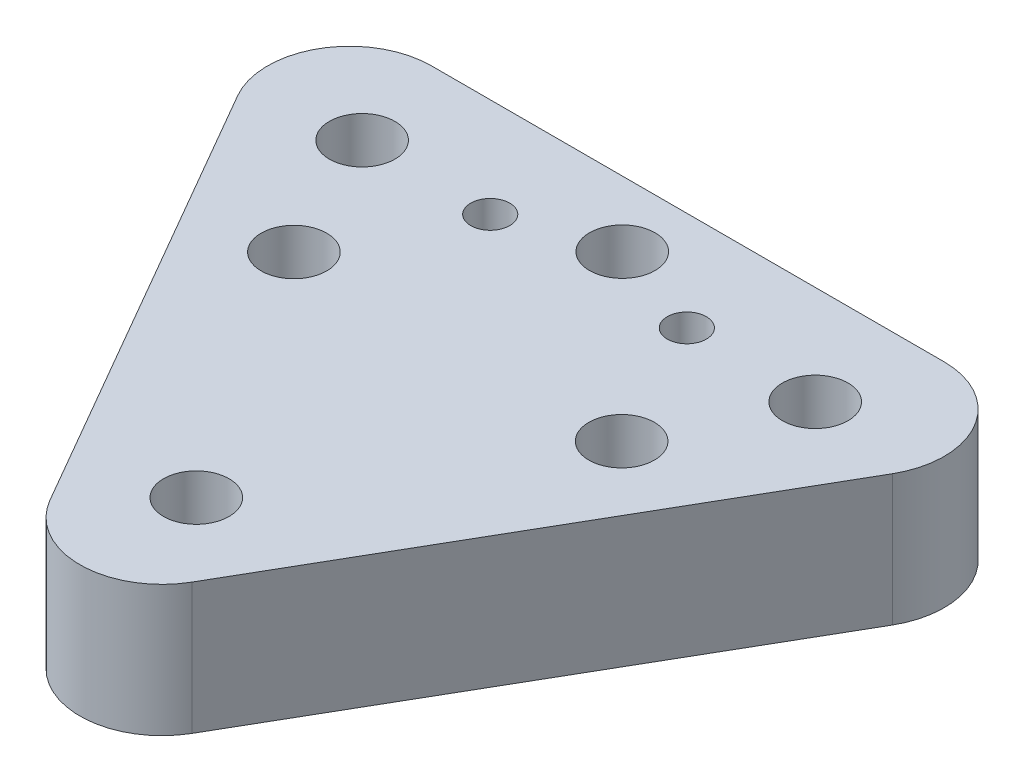
ISO-10303-21;
HEADER;
FILE_DESCRIPTION(('STEP AP214'),'2;1');
FILE_NAME('part.step','',(''),(''),'','','');
FILE_SCHEMA(('AUTOMOTIVE_DESIGN { 1 0 10303 214 1 1 1 1 }'));
ENDSEC;
DATA;
#1=APPLICATION_CONTEXT('core data for automotive mechanical design processes');
#2=APPLICATION_PROTOCOL_DEFINITION('international standard','automotive_design',2000,#1);
#3=PRODUCT_CONTEXT('',#1,'mechanical');
#4=PRODUCT('Part','Part','',(#3));
#5=PRODUCT_RELATED_PRODUCT_CATEGORY('part','',(#4));
#6=PRODUCT_DEFINITION_FORMATION('','',#4);
#7=PRODUCT_DEFINITION_CONTEXT('part definition',#1,'design');
#8=PRODUCT_DEFINITION('design','',#6,#7);
#9=PRODUCT_DEFINITION_SHAPE('','',#8);
#10=(LENGTH_UNIT() NAMED_UNIT(*) SI_UNIT(.MILLI.,.METRE.));
#11=(NAMED_UNIT(*) PLANE_ANGLE_UNIT() SI_UNIT($,.RADIAN.));
#12=(NAMED_UNIT(*) SI_UNIT($,.STERADIAN.) SOLID_ANGLE_UNIT());
#13=UNCERTAINTY_MEASURE_WITH_UNIT(LENGTH_MEASURE(1.E-05),#10,'distance_accuracy_value','');
#14=(GEOMETRIC_REPRESENTATION_CONTEXT(3) GLOBAL_UNCERTAINTY_ASSIGNED_CONTEXT((#13)) GLOBAL_UNIT_ASSIGNED_CONTEXT((#10,
#11,#12)) REPRESENTATION_CONTEXT('',''));
#15=CARTESIAN_POINT('',(0.,0.,0.));
#16=DIRECTION('',(0.,0.,1.));
#17=DIRECTION('',(1.,0.,0.));
#18=AXIS2_PLACEMENT_3D('',#15,#16,#17);
#19=CARTESIAN_POINT('',(-16.4111309816013,0.,1.40670066691386));
#20=DIRECTION('',(0.,1.,0.));
#21=DIRECTION('',(0.,0.,1.));
#22=AXIS2_PLACEMENT_3D('',#19,#20,#21);
#23=PLANE('',#22);
#24=CARTESIAN_POINT('',(1.80279534308345,0.,-4.03619239929081));
#25=DIRECTION('',(0.,1.,0.));
#26=DIRECTION('',(0.,0.,1.));
#27=AXIS2_PLACEMENT_3D('',#24,#25,#26);
#28=CIRCLE('',#27,0.595629999999993);
#29=CARTESIAN_POINT('',(1.80279534308345,0.,-3.44056239929081));
#30=VERTEX_POINT('',#29);
#31=EDGE_CURVE('E296',#30,#30,#28,.T.);
#32=ORIENTED_EDGE('',*,*,#31,.T.);
#33=EDGE_LOOP('',(#32));
#34=FACE_BOUND('',#33,.T.);
#35=CARTESIAN_POINT('',(7.80279534308345,0.,-4.03619239929081));
#36=DIRECTION('',(0.,1.,0.));
#37=DIRECTION('',(0.,0.,1.));
#38=AXIS2_PLACEMENT_3D('',#35,#36,#37);
#39=CIRCLE('',#38,0.595629999999994);
#40=CARTESIAN_POINT('',(7.80279534308345,0.,-3.44056239929081));
#41=VERTEX_POINT('',#40);
#42=EDGE_CURVE('E305',#41,#41,#39,.T.);
#43=ORIENTED_EDGE('',*,*,#42,.T.);
#44=EDGE_LOOP('',(#43));
#45=FACE_BOUND('',#44,.T.);
#46=CARTESIAN_POINT('',(4.80279534308345,0.,-5.06619239929081));
#47=DIRECTION('',(0.,-1.,0.));
#48=DIRECTION('',(0.,0.,-1.));
#49=AXIS2_PLACEMENT_3D('',#46,#47,#48);
#50=CIRCLE('',#49,0.999999999999989);
#51=CARTESIAN_POINT('',(4.80279534308345,0.,-6.06619239929079));
#52=VERTEX_POINT('',#51);
#53=EDGE_CURVE('E168',#52,#52,#50,.T.);
#54=ORIENTED_EDGE('',*,*,#53,.F.);
#55=EDGE_LOOP('',(#54));
#56=FACE_BOUND('',#55,.T.);
#57=CARTESIAN_POINT('',(9.80279534308345,0.,-0.0461923992908066));
#58=DIRECTION('',(0.,-1.,0.));
#59=DIRECTION('',(0.,0.,-1.));
#60=AXIS2_PLACEMENT_3D('',#57,#58,#59);
#61=CIRCLE('',#60,0.999999999999989);
#62=CARTESIAN_POINT('',(9.80279534308345,0.,-1.0461923992908));
#63=VERTEX_POINT('',#62);
#64=EDGE_CURVE('E158',#63,#63,#61,.T.);
#65=ORIENTED_EDGE('',*,*,#64,.F.);
#66=EDGE_LOOP('',(#65));
#67=FACE_BOUND('',#66,.T.);
#68=CARTESIAN_POINT('',(-0.197204656916548,0.,-0.0461923992908066));
#69=DIRECTION('',(0.,-1.,0.));
#70=DIRECTION('',(0.,0.,-1.));
#71=AXIS2_PLACEMENT_3D('',#68,#69,#70);
#72=CIRCLE('',#71,0.999999999999989);
#73=CARTESIAN_POINT('',(-0.197204656916548,0.,-1.0461923992908));
#74=VERTEX_POINT('',#73);
#75=EDGE_CURVE('E155',#74,#74,#72,.T.);
#76=ORIENTED_EDGE('',*,*,#75,.F.);
#77=EDGE_LOOP('',(#76));
#78=FACE_BOUND('',#77,.T.);
#79=CARTESIAN_POINT('',(4.80279534308345,0.,-0.0491349625871208));
#80=DIRECTION('',(0.,-1.,0.));
#81=DIRECTION('',(0.,0.,-1.));
#82=AXIS2_PLACEMENT_3D('',#79,#80,#81);
#83=CIRCLE('',#82,0.799999999999999);
#84=CARTESIAN_POINT('',(4.80279534308345,0.,-0.84913496258712));
#85=VERTEX_POINT('',#84);
#86=EDGE_CURVE('E154',#85,#85,#83,.T.);
#87=ORIENTED_EDGE('',*,*,#86,.F.);
#88=EDGE_LOOP('',(#87));
#89=FACE_BOUND('',#88,.T.);
#90=CARTESIAN_POINT('',(11.71622639985,0.,-4.04060624423512));
#91=DIRECTION('',(0.,1.,0.));
#92=DIRECTION('',(0.,0.,1.));
#93=AXIS2_PLACEMENT_3D('',#90,#91,#92);
#94=CIRCLE('',#93,2.38124999999938);
#95=CARTESIAN_POINT('',(11.71622639985,0.,-1.65935624423574));
#96=VERTEX_POINT('',#95);
#97=EDGE_CURVE('E182',#96,#96,#94,.T.);
#98=ORIENTED_EDGE('',*,*,#97,.T.);
#99=EDGE_LOOP('',(#98));
#100=FACE_BOUND('',#99,.T.);
#101=CARTESIAN_POINT('',(4.80279534308331,0.,8.98497991082108));
#102=DIRECTION('',(0.,1.,0.));
#103=DIRECTION('',(0.,0.,1.));
#104=AXIS2_PLACEMENT_3D('',#101,#102,#103);
#105=CIRCLE('',#104,2.49999999999972);
#106=CARTESIAN_POINT('',(6.96785885254439,0.,10.2349799108209));
#107=VERTEX_POINT('',#106);
#108=CARTESIAN_POINT('',(2.63773183362258,0.,10.2349799108209));
#109=VERTEX_POINT('',#108);
#110=EDGE_CURVE('E126',#107,#109,#105,.F.);
#111=ORIENTED_EDGE('',*,*,#110,.T.);
#112=DIRECTION('',(0.500000000000009,0.,0.866025403784434));
#113=VECTOR('',#112,1.);
#114=CARTESIAN_POINT('',(-5.94724091864677,0.,-4.63462907770371));
#115=LINE('',#114,#113);
#116=CARTESIAN_POINT('',(-5.18604114745575,0.,-3.3161923992911));
#117=VERTEX_POINT('',#116);
#118=EDGE_CURVE('E139',#117,#109,#115,.T.);
#119=ORIENTED_EDGE('',*,*,#118,.F.);
#120=CARTESIAN_POINT('',(-3.02097763799502,0.,-4.56619239929088));
#121=DIRECTION('',(0.,1.,0.));
#122=DIRECTION('',(0.,0.,1.));
#123=AXIS2_PLACEMENT_3D('',#120,#121,#122);
#124=CIRCLE('',#123,2.49999999999975);
#125=CARTESIAN_POINT('',(-3.02097763799485,0.,-7.06619239929081));
#126=VERTEX_POINT('',#125);
#127=EDGE_CURVE('E137',#117,#126,#124,.F.);
#128=ORIENTED_EDGE('',*,*,#127,.T.);
#129=DIRECTION('',(-1.,0.,0.));
#130=VECTOR('',#129,1.);
#131=CARTESIAN_POINT('',(-16.4111309816013,0.,-7.06619239929081));
#132=LINE('',#131,#130);
#133=CARTESIAN_POINT('',(12.6265683241618,0.,-7.06619239929081));
#134=VERTEX_POINT('',#133);
#135=EDGE_CURVE('E109',#134,#126,#132,.T.);
#136=ORIENTED_EDGE('',*,*,#135,.F.);
#137=CARTESIAN_POINT('',(12.6265683241616,0.,-4.56619239929093));
#138=DIRECTION('',(0.,1.,0.));
#139=DIRECTION('',(0.,0.,1.));
#140=AXIS2_PLACEMENT_3D('',#137,#138,#139);
#141=CIRCLE('',#140,2.49999999999987);
#142=CARTESIAN_POINT('',(14.7916318336227,0.,-3.31619239929111));
#143=VERTEX_POINT('',#142);
#144=EDGE_CURVE('E133',#143,#134,#141,.T.);
#145=ORIENTED_EDGE('',*,*,#144,.F.);
#146=DIRECTION('',(0.500000000000006,0.,-0.866025403784435));
#147=VECTOR('',#146,1.);
#148=CARTESIAN_POINT('',(4.94586844247103,0.,13.7371700334849));
#149=LINE('',#148,#147);
#150=EDGE_CURVE('E129',#107,#143,#149,.T.);
#151=ORIENTED_EDGE('',*,*,#150,.F.);
#152=EDGE_LOOP('',(#111,#119,#128,#136,#145,#151));
#153=FACE_BOUND('',#152,.T.);
#154=CARTESIAN_POINT('',(4.80279534308406,0.,7.93380760070919));
#155=DIRECTION('',(0.,1.,0.));
#156=DIRECTION('',(0.,0.,1.));
#157=AXIS2_PLACEMENT_3D('',#154,#155,#156);
#158=CIRCLE('',#157,2.38124999999972);
#159=CARTESIAN_POINT('',(4.80279534308406,0.,10.3150576007089));
#160=VERTEX_POINT('',#159);
#161=EDGE_CURVE('E185',#160,#160,#158,.T.);
#162=ORIENTED_EDGE('',*,*,#161,.T.);
#163=EDGE_LOOP('',(#162));
#164=FACE_BOUND('',#163,.T.);
#165=CARTESIAN_POINT('',(-2.11063571368305,0.,-4.04060624423513));
#166=DIRECTION('',(0.,1.,0.));
#167=DIRECTION('',(0.,0.,1.));
#168=AXIS2_PLACEMENT_3D('',#165,#166,#167);
#169=CIRCLE('',#168,2.38124999999953);
#170=CARTESIAN_POINT('',(-2.11063571368305,0.,-1.6593562442356));
#171=VERTEX_POINT('',#170);
#172=EDGE_CURVE('E151',#171,#171,#169,.T.);
#173=ORIENTED_EDGE('',*,*,#172,.T.);
#174=EDGE_LOOP('',(#173));
#175=FACE_BOUND('',#174,.T.);
#176=ADVANCED_FACE('F33',(#34,#45,#56,#67,#78,#89,#100,#153,#164,#175),#23,.F.);
#177=CARTESIAN_POINT('',(4.80279534308331,4.,8.98497991082108));
#178=DIRECTION('',(0.,-1.,0.));
#179=DIRECTION('',(0.,0.,-1.));
#180=AXIS2_PLACEMENT_3D('',#177,#178,#179);
#181=CYLINDRICAL_SURFACE('',#180,2.49999999999972);
#182=ORIENTED_EDGE('',*,*,#110,.F.);
#183=DIRECTION('',(0.,-1.,0.));
#184=VECTOR('',#183,1.);
#185=CARTESIAN_POINT('',(6.96785885254439,4.,10.2349799108209));
#186=LINE('',#185,#184);
#187=CARTESIAN_POINT('',(6.96785885254439,4.,10.2349799108209));
#188=VERTEX_POINT('',#187);
#189=EDGE_CURVE('E11',#188,#107,#186,.T.);
#190=ORIENTED_EDGE('',*,*,#189,.F.);
#191=CARTESIAN_POINT('',(4.80279534308331,4.,8.98497991082108));
#192=DIRECTION('',(0.,1.,0.));
#193=DIRECTION('',(0.,0.,1.));
#194=AXIS2_PLACEMENT_3D('',#191,#192,#193);
#195=CIRCLE('',#194,2.49999999999972);
#196=CARTESIAN_POINT('',(2.63773183362258,4.,10.2349799108209));
#197=VERTEX_POINT('',#196);
#198=EDGE_CURVE('E200',#188,#197,#195,.F.);
#199=ORIENTED_EDGE('',*,*,#198,.T.);
#200=DIRECTION('',(0.,-1.,0.));
#201=VECTOR('',#200,1.);
#202=CARTESIAN_POINT('',(2.63773183362258,4.,10.2349799108209));
#203=LINE('',#202,#201);
#204=EDGE_CURVE('E81',#197,#109,#203,.T.);
#205=ORIENTED_EDGE('',*,*,#204,.T.);
#206=EDGE_LOOP('',(#182,#190,#199,#205));
#207=FACE_BOUND('',#206,.T.);
#208=ADVANCED_FACE('F212',(#207),#181,.T.);
#209=CARTESIAN_POINT('',(4.94586844247103,4.,13.7371700334849));
#210=DIRECTION('',(-0.866025403784435,0.,-0.500000000000006));
#211=DIRECTION('',(-0.500000000000006,0.,0.866025403784435));
#212=AXIS2_PLACEMENT_3D('',#209,#210,#211);
#213=PLANE('',#212);
#214=ORIENTED_EDGE('',*,*,#150,.T.);
#215=DIRECTION('',(0.,-1.,0.));
#216=VECTOR('',#215,1.);
#217=CARTESIAN_POINT('',(14.7916318336227,4.,-3.31619239929111));
#218=LINE('',#217,#216);
#219=CARTESIAN_POINT('',(14.7916318336227,4.,-3.31619239929111));
#220=VERTEX_POINT('',#219);
#221=EDGE_CURVE('E43',#220,#143,#218,.T.);
#222=ORIENTED_EDGE('',*,*,#221,.F.);
#223=DIRECTION('',(0.500000000000006,0.,-0.866025403784435));
#224=VECTOR('',#223,1.);
#225=CARTESIAN_POINT('',(4.94586844247103,4.,13.7371700334849));
#226=LINE('',#225,#224);
#227=EDGE_CURVE('E202',#188,#220,#226,.T.);
#228=ORIENTED_EDGE('',*,*,#227,.F.);
#229=ORIENTED_EDGE('',*,*,#189,.T.);
#230=EDGE_LOOP('',(#214,#222,#228,#229));
#231=FACE_BOUND('',#230,.T.);
#232=ADVANCED_FACE('F205',(#231),#213,.F.);
#233=CARTESIAN_POINT('',(12.6265683241616,4.,-4.56619239929093));
#234=DIRECTION('',(0.,-1.,0.));
#235=DIRECTION('',(0.,0.,-1.));
#236=AXIS2_PLACEMENT_3D('',#233,#234,#235);
#237=CYLINDRICAL_SURFACE('',#236,2.49999999999987);
#238=ORIENTED_EDGE('',*,*,#144,.T.);
#239=DIRECTION('',(0.,-1.,0.));
#240=VECTOR('',#239,1.);
#241=CARTESIAN_POINT('',(12.6265683241618,4.,-7.06619239929081));
#242=LINE('',#241,#240);
#243=CARTESIAN_POINT('',(12.6265683241618,4.,-7.06619239929081));
#244=VERTEX_POINT('',#243);
#245=EDGE_CURVE('E113',#244,#134,#242,.T.);
#246=ORIENTED_EDGE('',*,*,#245,.F.);
#247=CARTESIAN_POINT('',(12.6265683241616,4.,-4.56619239929093));
#248=DIRECTION('',(0.,1.,0.));
#249=DIRECTION('',(0.,0.,1.));
#250=AXIS2_PLACEMENT_3D('',#247,#248,#249);
#251=CIRCLE('',#250,2.49999999999987);
#252=EDGE_CURVE('E101',#220,#244,#251,.T.);
#253=ORIENTED_EDGE('',*,*,#252,.F.);
#254=ORIENTED_EDGE('',*,*,#221,.T.);
#255=EDGE_LOOP('',(#238,#246,#253,#254));
#256=FACE_BOUND('',#255,.T.);
#257=ADVANCED_FACE('F208',(#256),#237,.T.);
#258=CARTESIAN_POINT('',(-16.4111309816013,4.,-7.06619239929081));
#259=DIRECTION('',(0.,0.,1.));
#260=DIRECTION('',(1.,0.,0.));
#261=AXIS2_PLACEMENT_3D('',#258,#259,#260);
#262=PLANE('',#261);
#263=ORIENTED_EDGE('',*,*,#135,.T.);
#264=DIRECTION('',(0.,-1.,0.));
#265=VECTOR('',#264,1.);
#266=CARTESIAN_POINT('',(-3.02097763799485,4.,-7.06619239929081));
#267=LINE('',#266,#265);
#268=CARTESIAN_POINT('',(-3.02097763799485,4.,-7.06619239929081));
#269=VERTEX_POINT('',#268);
#270=EDGE_CURVE('E107',#269,#126,#267,.T.);
#271=ORIENTED_EDGE('',*,*,#270,.F.);
#272=DIRECTION('',(-1.,0.,0.));
#273=VECTOR('',#272,1.);
#274=CARTESIAN_POINT('',(-16.4111309816013,4.,-7.06619239929081));
#275=LINE('',#274,#273);
#276=EDGE_CURVE('E94',#244,#269,#275,.T.);
#277=ORIENTED_EDGE('',*,*,#276,.F.);
#278=ORIENTED_EDGE('',*,*,#245,.T.);
#279=EDGE_LOOP('',(#263,#271,#277,#278));
#280=FACE_BOUND('',#279,.T.);
#281=ADVANCED_FACE('F108',(#280),#262,.F.);
#282=CARTESIAN_POINT('',(-3.02097763799502,4.,-4.56619239929088));
#283=DIRECTION('',(0.,-1.,0.));
#284=DIRECTION('',(0.,0.,-1.));
#285=AXIS2_PLACEMENT_3D('',#282,#283,#284);
#286=CYLINDRICAL_SURFACE('',#285,2.49999999999975);
#287=ORIENTED_EDGE('',*,*,#127,.F.);
#288=DIRECTION('',(0.,-1.,0.));
#289=VECTOR('',#288,1.);
#290=CARTESIAN_POINT('',(-5.18604114745575,4.,-3.3161923992911));
#291=LINE('',#290,#289);
#292=CARTESIAN_POINT('',(-5.18604114745575,4.,-3.3161923992911));
#293=VERTEX_POINT('',#292);
#294=EDGE_CURVE('E74',#293,#117,#291,.T.);
#295=ORIENTED_EDGE('',*,*,#294,.F.);
#296=CARTESIAN_POINT('',(-3.02097763799502,4.,-4.56619239929088));
#297=DIRECTION('',(0.,1.,0.));
#298=DIRECTION('',(0.,0.,1.));
#299=AXIS2_PLACEMENT_3D('',#296,#297,#298);
#300=CIRCLE('',#299,2.49999999999975);
#301=EDGE_CURVE('E99',#293,#269,#300,.F.);
#302=ORIENTED_EDGE('',*,*,#301,.T.);
#303=ORIENTED_EDGE('',*,*,#270,.T.);
#304=EDGE_LOOP('',(#287,#295,#302,#303));
#305=FACE_BOUND('',#304,.T.);
#306=ADVANCED_FACE('F115',(#305),#286,.T.);
#307=CARTESIAN_POINT('',(4.80279534308406,4.,7.93380760070919));
#308=DIRECTION('',(0.,-1.,0.));
#309=DIRECTION('',(0.,0.,-1.));
#310=AXIS2_PLACEMENT_3D('',#307,#308,#309);
#311=CYLINDRICAL_SURFACE('',#310,0.999999999998708);
#312=CARTESIAN_POINT('',(4.80279534308406,2.,7.93380760070919));
#313=DIRECTION('',(0.,1.,0.));
#314=DIRECTION('',(0.,0.,1.));
#315=AXIS2_PLACEMENT_3D('',#312,#313,#314);
#316=CIRCLE('',#315,0.999999999998708);
#317=CARTESIAN_POINT('',(4.80279534308406,2.,8.9338076007079));
#318=VERTEX_POINT('',#317);
#319=EDGE_CURVE('E191',#318,#318,#316,.T.);
#320=ORIENTED_EDGE('',*,*,#319,.F.);
#321=EDGE_LOOP('',(#320));
#322=FACE_BOUND('',#321,.T.);
#323=CARTESIAN_POINT('',(4.80279534308406,4.,7.93380760070919));
#324=DIRECTION('',(0.,1.,0.));
#325=DIRECTION('',(0.,0.,1.));
#326=AXIS2_PLACEMENT_3D('',#323,#324,#325);
#327=CIRCLE('',#326,0.999999999998708);
#328=CARTESIAN_POINT('',(4.80279534308406,4.,8.9338076007079));
#329=VERTEX_POINT('',#328);
#330=EDGE_CURVE('E117',#329,#329,#327,.T.);
#331=ORIENTED_EDGE('',*,*,#330,.T.);
#332=EDGE_LOOP('',(#331));
#333=FACE_BOUND('',#332,.T.);
#334=ADVANCED_FACE('F228',(#322,#333),#311,.F.);
#335=CARTESIAN_POINT('',(-5.94724091864677,4.,-4.63462907770371));
#336=DIRECTION('',(0.866025403784433,0.,-0.500000000000009));
#337=DIRECTION('',(-0.500000000000009,0.,-0.866025403784434));
#338=AXIS2_PLACEMENT_3D('',#335,#336,#337);
#339=PLANE('',#338);
#340=ORIENTED_EDGE('',*,*,#118,.T.);
#341=ORIENTED_EDGE('',*,*,#204,.F.);
#342=DIRECTION('',(0.500000000000009,0.,0.866025403784434));
#343=VECTOR('',#342,1.);
#344=CARTESIAN_POINT('',(-5.94724091864677,4.,-4.63462907770371));
#345=LINE('',#344,#343);
#346=EDGE_CURVE('E52',#293,#197,#345,.T.);
#347=ORIENTED_EDGE('',*,*,#346,.F.);
#348=ORIENTED_EDGE('',*,*,#294,.T.);
#349=EDGE_LOOP('',(#340,#341,#347,#348));
#350=FACE_BOUND('',#349,.T.);
#351=ADVANCED_FACE('F211',(#350),#339,.F.);
#352=CARTESIAN_POINT('',(-2.11063571368305,4.,-4.04060624423513));
#353=DIRECTION('',(0.,-1.,0.));
#354=DIRECTION('',(0.,0.,-1.));
#355=AXIS2_PLACEMENT_3D('',#352,#353,#354);
#356=CYLINDRICAL_SURFACE('',#355,0.999999999999094);
#357=CARTESIAN_POINT('',(-2.11063571368305,2.,-4.04060624423513));
#358=DIRECTION('',(0.,1.,0.));
#359=DIRECTION('',(0.,0.,1.));
#360=AXIS2_PLACEMENT_3D('',#357,#358,#359);
#361=CIRCLE('',#360,0.999999999999094);
#362=CARTESIAN_POINT('',(-2.11063571368305,2.,-3.04060624423603));
#363=VERTEX_POINT('',#362);
#364=EDGE_CURVE('E147',#363,#363,#361,.T.);
#365=ORIENTED_EDGE('',*,*,#364,.F.);
#366=EDGE_LOOP('',(#365));
#367=FACE_BOUND('',#366,.T.);
#368=CARTESIAN_POINT('',(-2.11063571368305,4.,-4.04060624423513));
#369=DIRECTION('',(0.,1.,0.));
#370=DIRECTION('',(0.,0.,1.));
#371=AXIS2_PLACEMENT_3D('',#368,#369,#370);
#372=CIRCLE('',#371,0.999999999999094);
#373=CARTESIAN_POINT('',(-2.11063571368305,4.,-3.04060624423603));
#374=VERTEX_POINT('',#373);
#375=EDGE_CURVE('E141',#374,#374,#372,.T.);
#376=ORIENTED_EDGE('',*,*,#375,.T.);
#377=EDGE_LOOP('',(#376));
#378=FACE_BOUND('',#377,.T.);
#379=ADVANCED_FACE('F35',(#367,#378),#356,.F.);
#380=CARTESIAN_POINT('',(11.71622639985,4.,-4.04060624423512));
#381=DIRECTION('',(0.,-1.,0.));
#382=DIRECTION('',(0.,0.,-1.));
#383=AXIS2_PLACEMENT_3D('',#380,#381,#382);
#384=CYLINDRICAL_SURFACE('',#383,0.99999999999917);
#385=CARTESIAN_POINT('',(11.71622639985,2.,-4.04060624423512));
#386=DIRECTION('',(0.,1.,0.));
#387=DIRECTION('',(0.,0.,1.));
#388=AXIS2_PLACEMENT_3D('',#385,#386,#387);
#389=CIRCLE('',#388,0.99999999999917);
#390=CARTESIAN_POINT('',(11.71622639985,2.,-3.04060624423595));
#391=VERTEX_POINT('',#390);
#392=EDGE_CURVE('E186',#391,#391,#389,.T.);
#393=ORIENTED_EDGE('',*,*,#392,.F.);
#394=EDGE_LOOP('',(#393));
#395=FACE_BOUND('',#394,.T.);
#396=CARTESIAN_POINT('',(11.71622639985,4.,-4.04060624423512));
#397=DIRECTION('',(0.,1.,0.));
#398=DIRECTION('',(0.,0.,1.));
#399=AXIS2_PLACEMENT_3D('',#396,#397,#398);
#400=CIRCLE('',#399,0.99999999999917);
#401=CARTESIAN_POINT('',(11.71622639985,4.,-3.04060624423595));
#402=VERTEX_POINT('',#401);
#403=EDGE_CURVE('E123',#402,#402,#400,.T.);
#404=ORIENTED_EDGE('',*,*,#403,.T.);
#405=EDGE_LOOP('',(#404));
#406=FACE_BOUND('',#405,.T.);
#407=ADVANCED_FACE('F234',(#395,#406),#384,.F.);
#408=CARTESIAN_POINT('',(-16.4111309816013,4.,1.40670066691386));
#409=DIRECTION('',(0.,1.,0.));
#410=DIRECTION('',(0.,0.,1.));
#411=AXIS2_PLACEMENT_3D('',#408,#409,#410);
#412=PLANE('',#411);
#413=CARTESIAN_POINT('',(1.80279534308345,4.,-4.03619239929081));
#414=DIRECTION('',(0.,1.,0.));
#415=DIRECTION('',(0.,0.,1.));
#416=AXIS2_PLACEMENT_3D('',#413,#414,#415);
#417=CIRCLE('',#416,0.595629999999988);
#418=CARTESIAN_POINT('',(1.80279534308345,4.,-3.44056239929082));
#419=VERTEX_POINT('',#418);
#420=EDGE_CURVE('E299',#419,#419,#417,.T.);
#421=ORIENTED_EDGE('',*,*,#420,.F.);
#422=EDGE_LOOP('',(#421));
#423=FACE_BOUND('',#422,.T.);
#424=CARTESIAN_POINT('',(7.80279534308345,4.,-4.03619239929081));
#425=DIRECTION('',(0.,1.,0.));
#426=DIRECTION('',(0.,0.,1.));
#427=AXIS2_PLACEMENT_3D('',#424,#425,#426);
#428=CIRCLE('',#427,0.595629999999988);
#429=CARTESIAN_POINT('',(7.80279534308345,4.,-3.44056239929082));
#430=VERTEX_POINT('',#429);
#431=EDGE_CURVE('E301',#430,#430,#428,.T.);
#432=ORIENTED_EDGE('',*,*,#431,.F.);
#433=EDGE_LOOP('',(#432));
#434=FACE_BOUND('',#433,.T.);
#435=CARTESIAN_POINT('',(4.80279534308345,4.,-5.06619239929081));
#436=DIRECTION('',(0.,1.,0.));
#437=DIRECTION('',(0.,0.,1.));
#438=AXIS2_PLACEMENT_3D('',#435,#436,#437);
#439=CIRCLE('',#438,0.999999999999988);
#440=CARTESIAN_POINT('',(4.80279534308345,4.,-4.06619239929082));
#441=VERTEX_POINT('',#440);
#442=EDGE_CURVE('E37',#441,#441,#439,.T.);
#443=ORIENTED_EDGE('',*,*,#442,.F.);
#444=EDGE_LOOP('',(#443));
#445=FACE_BOUND('',#444,.T.);
#446=CARTESIAN_POINT('',(9.80279534308345,4.,-0.0461923992908066));
#447=DIRECTION('',(0.,1.,0.));
#448=DIRECTION('',(0.,0.,1.));
#449=AXIS2_PLACEMENT_3D('',#446,#447,#448);
#450=CIRCLE('',#449,0.999999999999988);
#451=CARTESIAN_POINT('',(9.80279534308345,4.,0.953807600709181));
#452=VERTEX_POINT('',#451);
#453=EDGE_CURVE('E156',#452,#452,#450,.T.);
#454=ORIENTED_EDGE('',*,*,#453,.F.);
#455=EDGE_LOOP('',(#454));
#456=FACE_BOUND('',#455,.T.);
#457=CARTESIAN_POINT('',(-0.197204656916548,4.,-0.0461923992908066));
#458=DIRECTION('',(0.,1.,0.));
#459=DIRECTION('',(0.,0.,1.));
#460=AXIS2_PLACEMENT_3D('',#457,#458,#459);
#461=CIRCLE('',#460,0.999999999999988);
#462=CARTESIAN_POINT('',(-0.197204656916548,4.,0.953807600709181));
#463=VERTEX_POINT('',#462);
#464=EDGE_CURVE('E152',#463,#463,#461,.T.);
#465=ORIENTED_EDGE('',*,*,#464,.F.);
#466=EDGE_LOOP('',(#465));
#467=FACE_BOUND('',#466,.T.);
#468=ORIENTED_EDGE('',*,*,#375,.F.);
#469=EDGE_LOOP('',(#468));
#470=FACE_BOUND('',#469,.T.);
#471=ORIENTED_EDGE('',*,*,#198,.F.);
#472=ORIENTED_EDGE('',*,*,#227,.T.);
#473=ORIENTED_EDGE('',*,*,#252,.T.);
#474=ORIENTED_EDGE('',*,*,#276,.T.);
#475=ORIENTED_EDGE('',*,*,#301,.F.);
#476=ORIENTED_EDGE('',*,*,#346,.T.);
#477=EDGE_LOOP('',(#471,#472,#473,#474,#475,#476));
#478=FACE_BOUND('',#477,.T.);
#479=ORIENTED_EDGE('',*,*,#330,.F.);
#480=EDGE_LOOP('',(#479));
#481=FACE_BOUND('',#480,.T.);
#482=ORIENTED_EDGE('',*,*,#403,.F.);
#483=EDGE_LOOP('',(#482));
#484=FACE_BOUND('',#483,.T.);
#485=ADVANCED_FACE('F96',(#423,#434,#445,#456,#467,#470,#478,#481,#484),#412,.T.);
#486=CARTESIAN_POINT('',(4.80279534308406,2.,7.93380760070919));
#487=DIRECTION('',(0.,-1.,0.));
#488=DIRECTION('',(0.,0.,-1.));
#489=AXIS2_PLACEMENT_3D('',#486,#487,#488);
#490=CYLINDRICAL_SURFACE('',#489,2.38124999999972);
#491=CARTESIAN_POINT('',(4.80279534308406,2.,7.93380760070919));
#492=DIRECTION('',(0.,1.,0.));
#493=DIRECTION('',(0.,0.,1.));
#494=AXIS2_PLACEMENT_3D('',#491,#492,#493);
#495=CIRCLE('',#494,2.38124999999972);
#496=CARTESIAN_POINT('',(4.80279534308406,2.,10.3150576007089));
#497=VERTEX_POINT('',#496);
#498=EDGE_CURVE('E130',#497,#497,#495,.T.);
#499=ORIENTED_EDGE('',*,*,#498,.T.);
#500=EDGE_LOOP('',(#499));
#501=FACE_BOUND('',#500,.T.);
#502=ORIENTED_EDGE('',*,*,#161,.F.);
#503=EDGE_LOOP('',(#502));
#504=FACE_BOUND('',#503,.T.);
#505=ADVANCED_FACE('F240',(#501,#504),#490,.F.);
#506=CARTESIAN_POINT('',(-16.4111309816013,2.,1.40670066691386));
#507=DIRECTION('',(0.,1.,0.));
#508=DIRECTION('',(0.,0.,1.));
#509=AXIS2_PLACEMENT_3D('',#506,#507,#508);
#510=PLANE('',#509);
#511=ORIENTED_EDGE('',*,*,#319,.T.);
#512=EDGE_LOOP('',(#511));
#513=FACE_BOUND('',#512,.T.);
#514=ORIENTED_EDGE('',*,*,#498,.F.);
#515=EDGE_LOOP('',(#514));
#516=FACE_BOUND('',#515,.T.);
#517=ADVANCED_FACE('F244',(#513,#516),#510,.F.);
#518=CARTESIAN_POINT('',(11.71622639985,2.,-4.04060624423512));
#519=DIRECTION('',(0.,-1.,0.));
#520=DIRECTION('',(0.,0.,-1.));
#521=AXIS2_PLACEMENT_3D('',#518,#519,#520);
#522=CYLINDRICAL_SURFACE('',#521,2.38124999999938);
#523=CARTESIAN_POINT('',(11.71622639985,2.,-4.04060624423512));
#524=DIRECTION('',(0.,1.,0.));
#525=DIRECTION('',(0.,0.,1.));
#526=AXIS2_PLACEMENT_3D('',#523,#524,#525);
#527=CIRCLE('',#526,2.38124999999938);
#528=CARTESIAN_POINT('',(11.71622639985,2.,-1.65935624423574));
#529=VERTEX_POINT('',#528);
#530=EDGE_CURVE('E150',#529,#529,#527,.T.);
#531=ORIENTED_EDGE('',*,*,#530,.T.);
#532=EDGE_LOOP('',(#531));
#533=FACE_BOUND('',#532,.T.);
#534=ORIENTED_EDGE('',*,*,#97,.F.);
#535=EDGE_LOOP('',(#534));
#536=FACE_BOUND('',#535,.T.);
#537=ADVANCED_FACE('F248',(#533,#536),#522,.F.);
#538=CARTESIAN_POINT('',(-16.4111309816013,2.,1.40670066691386));
#539=DIRECTION('',(0.,1.,0.));
#540=DIRECTION('',(0.,0.,1.));
#541=AXIS2_PLACEMENT_3D('',#538,#539,#540);
#542=PLANE('',#541);
#543=ORIENTED_EDGE('',*,*,#392,.T.);
#544=EDGE_LOOP('',(#543));
#545=FACE_BOUND('',#544,.T.);
#546=ORIENTED_EDGE('',*,*,#530,.F.);
#547=EDGE_LOOP('',(#546));
#548=FACE_BOUND('',#547,.T.);
#549=ADVANCED_FACE('F250',(#545,#548),#542,.F.);
#550=CARTESIAN_POINT('',(-2.11063571368305,2.,-4.04060624423513));
#551=DIRECTION('',(0.,-1.,0.));
#552=DIRECTION('',(0.,0.,-1.));
#553=AXIS2_PLACEMENT_3D('',#550,#551,#552);
#554=CYLINDRICAL_SURFACE('',#553,2.38124999999953);
#555=CARTESIAN_POINT('',(-2.11063571368305,2.,-4.04060624423513));
#556=DIRECTION('',(0.,1.,0.));
#557=DIRECTION('',(0.,0.,1.));
#558=AXIS2_PLACEMENT_3D('',#555,#556,#557);
#559=CIRCLE('',#558,2.38124999999953);
#560=CARTESIAN_POINT('',(-2.11063571368305,2.,-1.6593562442356));
#561=VERTEX_POINT('',#560);
#562=EDGE_CURVE('E177',#561,#561,#559,.T.);
#563=ORIENTED_EDGE('',*,*,#562,.T.);
#564=EDGE_LOOP('',(#563));
#565=FACE_BOUND('',#564,.T.);
#566=ORIENTED_EDGE('',*,*,#172,.F.);
#567=EDGE_LOOP('',(#566));
#568=FACE_BOUND('',#567,.T.);
#569=ADVANCED_FACE('F253',(#565,#568),#554,.F.);
#570=CARTESIAN_POINT('',(-2.11063571368305,2.,-4.04060624423513));
#571=DIRECTION('',(0.,1.,0.));
#572=DIRECTION('',(0.,0.,1.));
#573=AXIS2_PLACEMENT_3D('',#570,#571,#572);
#574=PLANE('',#573);
#575=ORIENTED_EDGE('',*,*,#364,.T.);
#576=EDGE_LOOP('',(#575));
#577=FACE_BOUND('',#576,.T.);
#578=ORIENTED_EDGE('',*,*,#562,.F.);
#579=EDGE_LOOP('',(#578));
#580=FACE_BOUND('',#579,.T.);
#581=ADVANCED_FACE('F258',(#577,#580),#574,.F.);
#582=CARTESIAN_POINT('',(4.80279534308345,3.,-0.0491349625871208));
#583=DIRECTION('',(0.,-1.,0.));
#584=DIRECTION('',(0.,0.,-1.));
#585=AXIS2_PLACEMENT_3D('',#582,#583,#584);
#586=CONICAL_SURFACE('',#585,0.799999999999999,1.02974425867665);
#587=CARTESIAN_POINT('',(4.80279534308345,3.48068849522205,-0.0491349625871208));
#588=VERTEX_POINT('',#587);
#589=VERTEX_LOOP('',#588);
#590=FACE_BOUND('',#589,.T.);
#591=CARTESIAN_POINT('',(4.80279534308345,3.,-0.0491349625871208));
#592=DIRECTION('',(0.,-1.,0.));
#593=DIRECTION('',(0.,0.,-1.));
#594=AXIS2_PLACEMENT_3D('',#591,#592,#593);
#595=CIRCLE('',#594,0.799999999999999);
#596=CARTESIAN_POINT('',(4.80279534308345,3.,-0.84913496258712));
#597=VERTEX_POINT('',#596);
#598=EDGE_CURVE('E174',#597,#597,#595,.T.);
#599=ORIENTED_EDGE('',*,*,#598,.T.);
#600=EDGE_LOOP('',(#599));
#601=FACE_BOUND('',#600,.T.);
#602=ADVANCED_FACE('F261',(#590,#601),#586,.F.);
#603=CARTESIAN_POINT('',(4.80279534308345,0.,-0.0491349625871208));
#604=DIRECTION('',(0.,-1.,0.));
#605=DIRECTION('',(0.,0.,-1.));
#606=AXIS2_PLACEMENT_3D('',#603,#604,#605);
#607=CYLINDRICAL_SURFACE('',#606,0.799999999999999);
#608=ORIENTED_EDGE('',*,*,#598,.F.);
#609=EDGE_LOOP('',(#608));
#610=FACE_BOUND('',#609,.T.);
#611=ORIENTED_EDGE('',*,*,#86,.T.);
#612=EDGE_LOOP('',(#611));
#613=FACE_BOUND('',#612,.T.);
#614=ADVANCED_FACE('F268',(#610,#613),#607,.F.);
#615=CARTESIAN_POINT('',(-0.197204656916548,0.,-0.0461923992908066));
#616=DIRECTION('',(0.,-1.,0.));
#617=DIRECTION('',(0.,0.,-1.));
#618=AXIS2_PLACEMENT_3D('',#615,#616,#617);
#619=CYLINDRICAL_SURFACE('',#618,0.999999999999988);
#620=ORIENTED_EDGE('',*,*,#464,.T.);
#621=EDGE_LOOP('',(#620));
#622=FACE_BOUND('',#621,.T.);
#623=ORIENTED_EDGE('',*,*,#75,.T.);
#624=EDGE_LOOP('',(#623));
#625=FACE_BOUND('',#624,.T.);
#626=ADVANCED_FACE('F272',(#622,#625),#619,.F.);
#627=CARTESIAN_POINT('',(9.80279534308345,0.,-0.0461923992908066));
#628=DIRECTION('',(0.,-1.,0.));
#629=DIRECTION('',(0.,0.,-1.));
#630=AXIS2_PLACEMENT_3D('',#627,#628,#629);
#631=CYLINDRICAL_SURFACE('',#630,0.999999999999988);
#632=ORIENTED_EDGE('',*,*,#453,.T.);
#633=EDGE_LOOP('',(#632));
#634=FACE_BOUND('',#633,.T.);
#635=ORIENTED_EDGE('',*,*,#64,.T.);
#636=EDGE_LOOP('',(#635));
#637=FACE_BOUND('',#636,.T.);
#638=ADVANCED_FACE('F276',(#634,#637),#631,.F.);
#639=CARTESIAN_POINT('',(4.80279534308345,0.,-5.06619239929081));
#640=DIRECTION('',(0.,-1.,0.));
#641=DIRECTION('',(0.,0.,-1.));
#642=AXIS2_PLACEMENT_3D('',#639,#640,#641);
#643=CYLINDRICAL_SURFACE('',#642,0.999999999999988);
#644=ORIENTED_EDGE('',*,*,#442,.T.);
#645=EDGE_LOOP('',(#644));
#646=FACE_BOUND('',#645,.T.);
#647=ORIENTED_EDGE('',*,*,#53,.T.);
#648=EDGE_LOOP('',(#647));
#649=FACE_BOUND('',#648,.T.);
#650=ADVANCED_FACE('F280',(#646,#649),#643,.F.);
#651=CARTESIAN_POINT('',(7.80279534308345,4.,-4.03619239929081));
#652=DIRECTION('',(0.,1.,0.));
#653=DIRECTION('',(0.,0.,1.));
#654=AXIS2_PLACEMENT_3D('',#651,#652,#653);
#655=CYLINDRICAL_SURFACE('',#654,0.595629999999994);
#656=ORIENTED_EDGE('',*,*,#42,.F.);
#657=EDGE_LOOP('',(#656));
#658=FACE_BOUND('',#657,.T.);
#659=ORIENTED_EDGE('',*,*,#431,.T.);
#660=EDGE_LOOP('',(#659));
#661=FACE_BOUND('',#660,.T.);
#662=ADVANCED_FACE('F283',(#658,#661),#655,.F.);
#663=CARTESIAN_POINT('',(1.80279534308345,4.,-4.03619239929081));
#664=DIRECTION('',(0.,1.,0.));
#665=DIRECTION('',(0.,0.,1.));
#666=AXIS2_PLACEMENT_3D('',#663,#664,#665);
#667=CYLINDRICAL_SURFACE('',#666,0.595629999999993);
#668=ORIENTED_EDGE('',*,*,#31,.F.);
#669=EDGE_LOOP('',(#668));
#670=FACE_BOUND('',#669,.T.);
#671=ORIENTED_EDGE('',*,*,#420,.T.);
#672=EDGE_LOOP('',(#671));
#673=FACE_BOUND('',#672,.T.);
#674=ADVANCED_FACE('F287',(#670,#673),#667,.F.);
#675=CLOSED_SHELL('',(#176,#208,#232,#257,#281,#306,#334,#351,#379,#407,#485,#505,#517,#537,
#549,#569,#581,#602,#614,#626,#638,#650,#662,#674));
#676=MANIFOLD_SOLID_BREP('B2',#675);
#677=ADVANCED_BREP_SHAPE_REPRESENTATION('',(#18,#676),#14);
#678=SHAPE_DEFINITION_REPRESENTATION(#9,#677);
ENDSEC;
END-ISO-10303-21;
